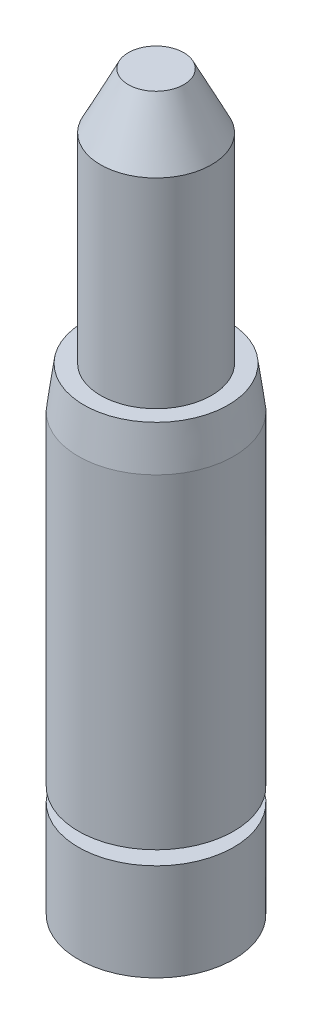
ISO-10303-21;
HEADER;
FILE_DESCRIPTION(('STEP AP214'),'2;1');
FILE_NAME('part.step','',(''),(''),'','','');
FILE_SCHEMA(('AUTOMOTIVE_DESIGN { 1 0 10303 214 1 1 1 1 }'));
ENDSEC;
DATA;
#1=APPLICATION_CONTEXT('core data for automotive mechanical design processes');
#2=APPLICATION_PROTOCOL_DEFINITION('international standard','automotive_design',2000,#1);
#3=PRODUCT_CONTEXT('',#1,'mechanical');
#4=PRODUCT('Part','Part','',(#3));
#5=PRODUCT_RELATED_PRODUCT_CATEGORY('part','',(#4));
#6=PRODUCT_DEFINITION_FORMATION('','',#4);
#7=PRODUCT_DEFINITION_CONTEXT('part definition',#1,'design');
#8=PRODUCT_DEFINITION('design','',#6,#7);
#9=PRODUCT_DEFINITION_SHAPE('','',#8);
#10=(LENGTH_UNIT() NAMED_UNIT(*) SI_UNIT(.MILLI.,.METRE.));
#11=(NAMED_UNIT(*) PLANE_ANGLE_UNIT() SI_UNIT($,.RADIAN.));
#12=(NAMED_UNIT(*) SI_UNIT($,.STERADIAN.) SOLID_ANGLE_UNIT());
#13=UNCERTAINTY_MEASURE_WITH_UNIT(LENGTH_MEASURE(1.E-05),#10,'distance_accuracy_value','');
#14=(GEOMETRIC_REPRESENTATION_CONTEXT(3) GLOBAL_UNCERTAINTY_ASSIGNED_CONTEXT((#13)) GLOBAL_UNIT_ASSIGNED_CONTEXT((#10,
#11,#12)) REPRESENTATION_CONTEXT('',''));
#15=CARTESIAN_POINT('',(0.,0.,0.));
#16=DIRECTION('',(0.,0.,1.));
#17=DIRECTION('',(1.,0.,0.));
#18=AXIS2_PLACEMENT_3D('',#15,#16,#17);
#19=CARTESIAN_POINT('',(17.78,0.,0.));
#20=DIRECTION('',(0.,-1.,0.));
#21=DIRECTION('',(0.,0.,-1.));
#22=AXIS2_PLACEMENT_3D('',#19,#20,#21);
#23=PLANE('',#22);
#24=CARTESIAN_POINT('',(0.,0.,0.));
#25=DIRECTION('',(0.,-1.,0.));
#26=DIRECTION('',(0.,0.,-1.));
#27=AXIS2_PLACEMENT_3D('',#24,#25,#26);
#28=CIRCLE('',#27,17.78);
#29=CARTESIAN_POINT('',(0.,0.,-17.78));
#30=VERTEX_POINT('',#29);
#31=EDGE_CURVE('E64',#30,#30,#28,.T.);
#32=ORIENTED_EDGE('',*,*,#31,.T.);
#33=EDGE_LOOP('',(#32));
#34=FACE_BOUND('',#33,.T.);
#35=ADVANCED_FACE('F30',(#34),#23,.T.);
#36=CARTESIAN_POINT('',(0.,167.64,0.));
#37=DIRECTION('',(0.,1.,0.));
#38=DIRECTION('',(0.,0.,1.));
#39=AXIS2_PLACEMENT_3D('',#36,#37,#38);
#40=PLANE('',#39);
#41=CARTESIAN_POINT('',(0.,167.64,0.));
#42=DIRECTION('',(0.,-1.,0.));
#43=DIRECTION('',(0.,0.,-1.));
#44=AXIS2_PLACEMENT_3D('',#41,#42,#43);
#45=CIRCLE('',#44,6.35);
#46=CARTESIAN_POINT('',(0.,167.64,-6.35));
#47=VERTEX_POINT('',#46);
#48=EDGE_CURVE('E10',#47,#47,#45,.T.);
#49=ORIENTED_EDGE('',*,*,#48,.F.);
#50=EDGE_LOOP('',(#49));
#51=FACE_BOUND('',#50,.T.);
#52=ADVANCED_FACE('F81',(#51),#40,.T.);
#53=CARTESIAN_POINT('',(0.,154.94,0.));
#54=DIRECTION('',(0.,-1.,0.));
#55=DIRECTION('',(0.,0.,-1.));
#56=AXIS2_PLACEMENT_3D('',#53,#54,#55);
#57=CONICAL_SURFACE('',#56,12.7,0.463647609000806);
#58=ORIENTED_EDGE('',*,*,#48,.T.);
#59=EDGE_LOOP('',(#58));
#60=FACE_BOUND('',#59,.T.);
#61=CARTESIAN_POINT('',(0.,154.94,0.));
#62=DIRECTION('',(0.,-1.,0.));
#63=DIRECTION('',(0.,0.,-1.));
#64=AXIS2_PLACEMENT_3D('',#61,#62,#63);
#65=CIRCLE('',#64,12.7);
#66=CARTESIAN_POINT('',(0.,154.94,-12.7));
#67=VERTEX_POINT('',#66);
#68=EDGE_CURVE('E36',#67,#67,#65,.T.);
#69=ORIENTED_EDGE('',*,*,#68,.F.);
#70=EDGE_LOOP('',(#69));
#71=FACE_BOUND('',#70,.T.);
#72=ADVANCED_FACE('F85',(#60,#71),#57,.T.);
#73=CARTESIAN_POINT('',(0.,0.,0.));
#74=DIRECTION('',(0.,-1.,0.));
#75=DIRECTION('',(0.,0.,-1.));
#76=AXIS2_PLACEMENT_3D('',#73,#74,#75);
#77=CYLINDRICAL_SURFACE('',#76,12.7);
#78=ORIENTED_EDGE('',*,*,#68,.T.);
#79=EDGE_LOOP('',(#78));
#80=FACE_BOUND('',#79,.T.);
#81=CARTESIAN_POINT('',(0.,109.22,0.));
#82=DIRECTION('',(0.,-1.,0.));
#83=DIRECTION('',(0.,0.,-1.));
#84=AXIS2_PLACEMENT_3D('',#81,#82,#83);
#85=CIRCLE('',#84,12.7);
#86=CARTESIAN_POINT('',(0.,109.22,-12.7));
#87=VERTEX_POINT('',#86);
#88=EDGE_CURVE('E40',#87,#87,#85,.T.);
#89=ORIENTED_EDGE('',*,*,#88,.F.);
#90=EDGE_LOOP('',(#89));
#91=FACE_BOUND('',#90,.T.);
#92=ADVANCED_FACE('F90',(#80,#91),#77,.T.);
#93=CARTESIAN_POINT('',(12.7,109.22,0.));
#94=DIRECTION('',(0.,1.,0.));
#95=DIRECTION('',(0.,0.,1.));
#96=AXIS2_PLACEMENT_3D('',#93,#94,#95);
#97=PLANE('',#96);
#98=ORIENTED_EDGE('',*,*,#88,.T.);
#99=EDGE_LOOP('',(#98));
#100=FACE_BOUND('',#99,.T.);
#101=CARTESIAN_POINT('',(0.,109.22,0.));
#102=DIRECTION('',(0.,-1.,0.));
#103=DIRECTION('',(0.,0.,-1.));
#104=AXIS2_PLACEMENT_3D('',#101,#102,#103);
#105=CIRCLE('',#104,16.51);
#106=CARTESIAN_POINT('',(0.,109.22,-16.51));
#107=VERTEX_POINT('',#106);
#108=EDGE_CURVE('E44',#107,#107,#105,.T.);
#109=ORIENTED_EDGE('',*,*,#108,.F.);
#110=EDGE_LOOP('',(#109));
#111=FACE_BOUND('',#110,.T.);
#112=ADVANCED_FACE('F95',(#100,#111),#97,.T.);
#113=CARTESIAN_POINT('',(0.,99.695,0.));
#114=DIRECTION('',(0.,-1.,0.));
#115=DIRECTION('',(0.,0.,-1.));
#116=AXIS2_PLACEMENT_3D('',#113,#114,#115);
#117=CONICAL_SURFACE('',#116,17.78,0.132551532296674);
#118=ORIENTED_EDGE('',*,*,#108,.T.);
#119=EDGE_LOOP('',(#118));
#120=FACE_BOUND('',#119,.T.);
#121=CARTESIAN_POINT('',(0.,99.695,0.));
#122=DIRECTION('',(0.,-1.,0.));
#123=DIRECTION('',(0.,0.,-1.));
#124=AXIS2_PLACEMENT_3D('',#121,#122,#123);
#125=CIRCLE('',#124,17.78);
#126=CARTESIAN_POINT('',(0.,99.695,-17.78));
#127=VERTEX_POINT('',#126);
#128=EDGE_CURVE('E49',#127,#127,#125,.T.);
#129=ORIENTED_EDGE('',*,*,#128,.F.);
#130=EDGE_LOOP('',(#129));
#131=FACE_BOUND('',#130,.T.);
#132=ADVANCED_FACE('F98',(#120,#131),#117,.T.);
#133=CARTESIAN_POINT('',(0.,0.,0.));
#134=DIRECTION('',(0.,-1.,0.));
#135=DIRECTION('',(0.,0.,-1.));
#136=AXIS2_PLACEMENT_3D('',#133,#134,#135);
#137=CYLINDRICAL_SURFACE('',#136,17.78);
#138=ORIENTED_EDGE('',*,*,#128,.T.);
#139=EDGE_LOOP('',(#138));
#140=FACE_BOUND('',#139,.T.);
#141=CARTESIAN_POINT('',(0.,25.4,0.));
#142=DIRECTION('',(0.,-1.,0.));
#143=DIRECTION('',(0.,0.,-1.));
#144=AXIS2_PLACEMENT_3D('',#141,#142,#143);
#145=CIRCLE('',#144,17.78);
#146=CARTESIAN_POINT('',(0.,25.4,-17.78));
#147=VERTEX_POINT('',#146);
#148=EDGE_CURVE('E52',#147,#147,#145,.T.);
#149=ORIENTED_EDGE('',*,*,#148,.F.);
#150=EDGE_LOOP('',(#149));
#151=FACE_BOUND('',#150,.T.);
#152=ADVANCED_FACE('F102',(#140,#151),#137,.T.);
#153=CARTESIAN_POINT('',(17.78,25.4,0.));
#154=DIRECTION('',(0.,-1.,0.));
#155=DIRECTION('',(0.,0.,-1.));
#156=AXIS2_PLACEMENT_3D('',#153,#154,#155);
#157=PLANE('',#156);
#158=ORIENTED_EDGE('',*,*,#148,.T.);
#159=EDGE_LOOP('',(#158));
#160=FACE_BOUND('',#159,.T.);
#161=CARTESIAN_POINT('',(0.,25.4,0.));
#162=DIRECTION('',(0.,-1.,0.));
#163=DIRECTION('',(0.,0.,-1.));
#164=AXIS2_PLACEMENT_3D('',#161,#162,#163);
#165=CIRCLE('',#164,12.7);
#166=CARTESIAN_POINT('',(0.,25.4,-12.7));
#167=VERTEX_POINT('',#166);
#168=EDGE_CURVE('E55',#167,#167,#165,.T.);
#169=ORIENTED_EDGE('',*,*,#168,.F.);
#170=EDGE_LOOP('',(#169));
#171=FACE_BOUND('',#170,.T.);
#172=ADVANCED_FACE('F106',(#160,#171),#157,.T.);
#173=CARTESIAN_POINT('',(0.,0.,0.));
#174=DIRECTION('',(0.,-1.,0.));
#175=DIRECTION('',(0.,0.,-1.));
#176=AXIS2_PLACEMENT_3D('',#173,#174,#175);
#177=CYLINDRICAL_SURFACE('',#176,12.7);
#178=ORIENTED_EDGE('',*,*,#168,.T.);
#179=EDGE_LOOP('',(#178));
#180=FACE_BOUND('',#179,.T.);
#181=CARTESIAN_POINT('',(0.,22.225,0.));
#182=DIRECTION('',(0.,-1.,0.));
#183=DIRECTION('',(0.,0.,-1.));
#184=AXIS2_PLACEMENT_3D('',#181,#182,#183);
#185=CIRCLE('',#184,12.7);
#186=CARTESIAN_POINT('',(0.,22.225,-12.7));
#187=VERTEX_POINT('',#186);
#188=EDGE_CURVE('E58',#187,#187,#185,.T.);
#189=ORIENTED_EDGE('',*,*,#188,.F.);
#190=EDGE_LOOP('',(#189));
#191=FACE_BOUND('',#190,.T.);
#192=ADVANCED_FACE('F77',(#180,#191),#177,.T.);
#193=CARTESIAN_POINT('',(12.7,22.225,0.));
#194=DIRECTION('',(0.,1.,0.));
#195=DIRECTION('',(0.,0.,1.));
#196=AXIS2_PLACEMENT_3D('',#193,#194,#195);
#197=PLANE('',#196);
#198=ORIENTED_EDGE('',*,*,#188,.T.);
#199=EDGE_LOOP('',(#198));
#200=FACE_BOUND('',#199,.T.);
#201=CARTESIAN_POINT('',(0.,22.225,0.));
#202=DIRECTION('',(0.,-1.,0.));
#203=DIRECTION('',(0.,0.,-1.));
#204=AXIS2_PLACEMENT_3D('',#201,#202,#203);
#205=CIRCLE('',#204,17.78);
#206=CARTESIAN_POINT('',(0.,22.225,-17.78));
#207=VERTEX_POINT('',#206);
#208=EDGE_CURVE('E61',#207,#207,#205,.T.);
#209=ORIENTED_EDGE('',*,*,#208,.F.);
#210=EDGE_LOOP('',(#209));
#211=FACE_BOUND('',#210,.T.);
#212=ADVANCED_FACE('F71',(#200,#211),#197,.T.);
#213=CARTESIAN_POINT('',(0.,0.,0.));
#214=DIRECTION('',(0.,-1.,0.));
#215=DIRECTION('',(0.,0.,-1.));
#216=AXIS2_PLACEMENT_3D('',#213,#214,#215);
#217=CYLINDRICAL_SURFACE('',#216,17.78);
#218=ORIENTED_EDGE('',*,*,#208,.T.);
#219=EDGE_LOOP('',(#218));
#220=FACE_BOUND('',#219,.T.);
#221=ORIENTED_EDGE('',*,*,#31,.F.);
#222=EDGE_LOOP('',(#221));
#223=FACE_BOUND('',#222,.T.);
#224=ADVANCED_FACE('F69',(#220,#223),#217,.T.);
#225=CLOSED_SHELL('',(#35,#52,#72,#92,#112,#132,#152,#172,#192,#212,#224));
#226=MANIFOLD_SOLID_BREP('B2',#225);
#227=ADVANCED_BREP_SHAPE_REPRESENTATION('',(#18,#226),#14);
#228=SHAPE_DEFINITION_REPRESENTATION(#9,#227);
ENDSEC;
END-ISO-10303-21;
